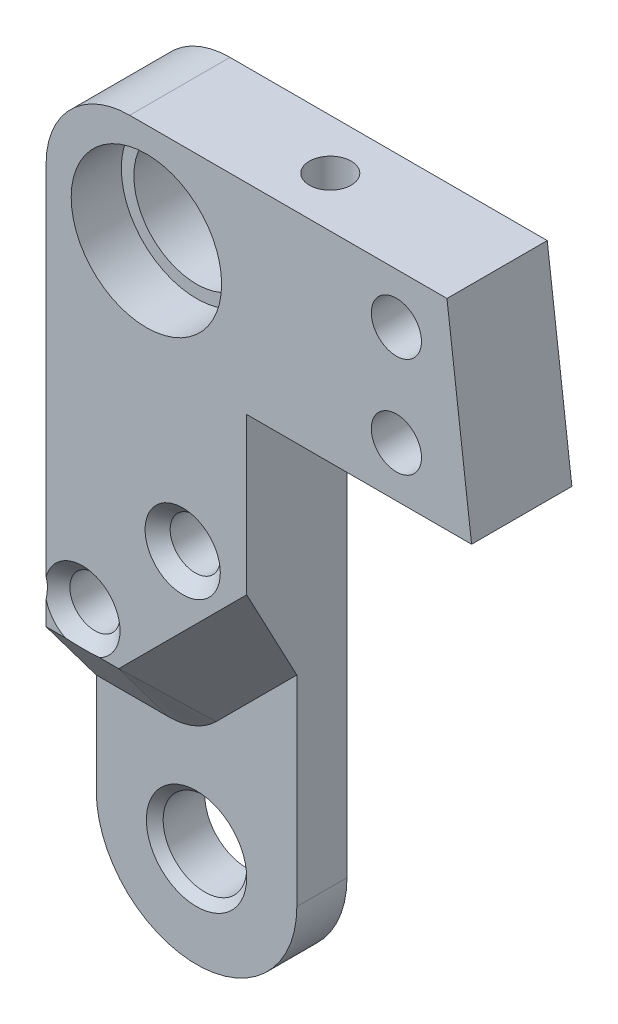
ISO-10303-21;
HEADER;
FILE_DESCRIPTION(('STEP AP214'),'2;1');
FILE_NAME('part.step','',(''),(''),'','','');
FILE_SCHEMA(('AUTOMOTIVE_DESIGN { 1 0 10303 214 1 1 1 1 }'));
ENDSEC;
DATA;
#1=APPLICATION_CONTEXT('core data for automotive mechanical design processes');
#2=APPLICATION_PROTOCOL_DEFINITION('international standard','automotive_design',2000,#1);
#3=PRODUCT_CONTEXT('',#1,'mechanical');
#4=PRODUCT('Part','Part','',(#3));
#5=PRODUCT_RELATED_PRODUCT_CATEGORY('part','',(#4));
#6=PRODUCT_DEFINITION_FORMATION('','',#4);
#7=PRODUCT_DEFINITION_CONTEXT('part definition',#1,'design');
#8=PRODUCT_DEFINITION('design','',#6,#7);
#9=PRODUCT_DEFINITION_SHAPE('','',#8);
#10=(LENGTH_UNIT() NAMED_UNIT(*) SI_UNIT(.MILLI.,.METRE.));
#11=(NAMED_UNIT(*) PLANE_ANGLE_UNIT() SI_UNIT($,.RADIAN.));
#12=(NAMED_UNIT(*) SI_UNIT($,.STERADIAN.) SOLID_ANGLE_UNIT());
#13=UNCERTAINTY_MEASURE_WITH_UNIT(LENGTH_MEASURE(1.E-05),#10,'distance_accuracy_value','');
#14=(GEOMETRIC_REPRESENTATION_CONTEXT(3) GLOBAL_UNCERTAINTY_ASSIGNED_CONTEXT((#13)) GLOBAL_UNIT_ASSIGNED_CONTEXT((#10,
#11,#12)) REPRESENTATION_CONTEXT('',''));
#15=CARTESIAN_POINT('',(0.,0.,0.));
#16=DIRECTION('',(0.,0.,1.));
#17=DIRECTION('',(1.,0.,0.));
#18=AXIS2_PLACEMENT_3D('',#15,#16,#17);
#19=CARTESIAN_POINT('',(-3.82842712474619,18.,-0.00100000000000013));
#20=DIRECTION('',(0.,0.,1.));
#21=DIRECTION('',(1.,0.,0.));
#22=AXIS2_PLACEMENT_3D('',#19,#20,#21);
#23=CYLINDRICAL_SURFACE('',#22,1.5);
#24=CARTESIAN_POINT('',(-3.82842712474619,18.,5.24999999999999));
#25=DIRECTION('',(0.,0.,1.));
#26=DIRECTION('',(1.,0.,0.));
#27=AXIS2_PLACEMENT_3D('',#24,#25,#26);
#28=CIRCLE('',#27,1.5);
#29=CARTESIAN_POINT('',(-2.32842712474619,18.,5.24999999999999));
#30=VERTEX_POINT('',#29);
#31=EDGE_CURVE('E214',#30,#30,#28,.T.);
#32=CARTESIAN_POINT('',(-3.82842712474619,18.,1.));
#33=DIRECTION('',(0.,0.,-1.));
#34=DIRECTION('',(-1.,0.,0.));
#35=AXIS2_PLACEMENT_3D('',#32,#33,#34);
#36=CIRCLE('',#35,1.5);
#37=CARTESIAN_POINT('',(-2.32842712474619,18.,1.));
#38=VERTEX_POINT('',#37);
#39=EDGE_CURVE('E38',#38,#38,#36,.F.);
#40=CARTESIAN_POINT('',(-2.32842712474619,18.,5.24999999999999));
#41=CARTESIAN_POINT('',(-2.32842712474619,18.,5.20572916666665));
#42=CARTESIAN_POINT('',(-2.32842712474619,18.,5.16145833333332));
#43=CARTESIAN_POINT('',(-2.32842712474619,18.,5.07291666666665));
#44=CARTESIAN_POINT('',(-2.32842712474619,18.,5.02864583333332));
#45=CARTESIAN_POINT('',(-2.32842712474619,18.,4.94010416666666));
#46=CARTESIAN_POINT('',(-2.32842712474619,18.,4.89583333333332));
#47=CARTESIAN_POINT('',(-2.32842712474619,18.,4.80729166666666));
#48=CARTESIAN_POINT('',(-2.32842712474619,18.,4.76302083333332));
#49=CARTESIAN_POINT('',(-2.32842712474619,18.,4.67447916666666));
#50=CARTESIAN_POINT('',(-2.32842712474619,18.,4.63020833333332));
#51=CARTESIAN_POINT('',(-2.32842712474619,18.,4.54166666666666));
#52=CARTESIAN_POINT('',(-2.32842712474619,18.,4.49739583333332));
#53=CARTESIAN_POINT('',(-2.32842712474619,18.,4.40885416666666));
#54=CARTESIAN_POINT('',(-2.32842712474619,18.,4.36458333333332));
#55=CARTESIAN_POINT('',(-2.32842712474619,18.,4.27604166666666));
#56=CARTESIAN_POINT('',(-2.32842712474619,18.,4.23177083333332));
#57=CARTESIAN_POINT('',(-2.32842712474619,18.,4.14322916666666));
#58=CARTESIAN_POINT('',(-2.32842712474619,18.,4.09895833333332));
#59=CARTESIAN_POINT('',(-2.32842712474619,18.,4.01041666666666));
#60=CARTESIAN_POINT('',(-2.32842712474619,18.,3.96614583333332));
#61=CARTESIAN_POINT('',(-2.32842712474619,18.,3.87760416666666));
#62=CARTESIAN_POINT('',(-2.32842712474619,18.,3.83333333333333));
#63=CARTESIAN_POINT('',(-2.32842712474619,18.,3.74479166666666));
#64=CARTESIAN_POINT('',(-2.32842712474619,18.,3.70052083333333));
#65=CARTESIAN_POINT('',(-2.32842712474619,18.,3.61197916666666));
#66=CARTESIAN_POINT('',(-2.32842712474619,18.,3.56770833333333));
#67=CARTESIAN_POINT('',(-2.32842712474619,18.,3.47916666666666));
#68=CARTESIAN_POINT('',(-2.32842712474619,18.,3.43489583333333));
#69=CARTESIAN_POINT('',(-2.32842712474619,18.,3.34635416666666));
#70=CARTESIAN_POINT('',(-2.32842712474619,18.,3.30208333333333));
#71=CARTESIAN_POINT('',(-2.32842712474619,18.,3.21354166666666));
#72=CARTESIAN_POINT('',(-2.32842712474619,18.,3.16927083333333));
#73=CARTESIAN_POINT('',(-2.32842712474619,18.,3.08072916666666));
#74=CARTESIAN_POINT('',(-2.32842712474619,18.,3.03645833333333));
#75=CARTESIAN_POINT('',(-2.32842712474619,18.,2.94791666666666));
#76=CARTESIAN_POINT('',(-2.32842712474619,18.,2.90364583333333));
#77=CARTESIAN_POINT('',(-2.32842712474619,18.,2.81510416666666));
#78=CARTESIAN_POINT('',(-2.32842712474619,18.,2.77083333333333));
#79=CARTESIAN_POINT('',(-2.32842712474619,18.,2.68229166666666));
#80=CARTESIAN_POINT('',(-2.32842712474619,18.,2.63802083333333));
#81=CARTESIAN_POINT('',(-2.32842712474619,18.,2.54947916666666));
#82=CARTESIAN_POINT('',(-2.32842712474619,18.,2.50520833333333));
#83=CARTESIAN_POINT('',(-2.32842712474619,18.,2.41666666666666));
#84=CARTESIAN_POINT('',(-2.32842712474619,18.,2.37239583333333));
#85=CARTESIAN_POINT('',(-2.32842712474619,18.,2.28385416666666));
#86=CARTESIAN_POINT('',(-2.32842712474619,18.,2.23958333333333));
#87=CARTESIAN_POINT('',(-2.32842712474619,18.,2.15104166666666));
#88=CARTESIAN_POINT('',(-2.32842712474619,18.,2.10677083333333));
#89=CARTESIAN_POINT('',(-2.32842712474619,18.,2.01822916666666));
#90=CARTESIAN_POINT('',(-2.32842712474619,18.,1.97395833333333));
#91=CARTESIAN_POINT('',(-2.32842712474619,18.,1.88541666666666));
#92=CARTESIAN_POINT('',(-2.32842712474619,18.,1.84114583333333));
#93=CARTESIAN_POINT('',(-2.32842712474619,18.,1.75260416666666));
#94=CARTESIAN_POINT('',(-2.32842712474619,18.,1.70833333333333));
#95=CARTESIAN_POINT('',(-2.32842712474619,18.,1.61979166666666));
#96=CARTESIAN_POINT('',(-2.32842712474619,18.,1.57552083333333));
#97=CARTESIAN_POINT('',(-2.32842712474619,18.,1.48697916666667));
#98=CARTESIAN_POINT('',(-2.32842712474619,18.,1.44270833333333));
#99=CARTESIAN_POINT('',(-2.32842712474619,18.,1.35416666666667));
#100=CARTESIAN_POINT('',(-2.32842712474619,18.,1.30989583333333));
#101=CARTESIAN_POINT('',(-2.32842712474619,18.,1.22135416666667));
#102=CARTESIAN_POINT('',(-2.32842712474619,18.,1.17708333333333));
#103=CARTESIAN_POINT('',(-2.32842712474619,18.,1.08854166666667));
#104=CARTESIAN_POINT('',(-2.32842712474619,18.,1.04427083333333));
#105=CARTESIAN_POINT('',(-2.32842712474619,18.,1.));
#106=B_SPLINE_CURVE_WITH_KNOTS('',3,(#40,#41,#42,#43,#44,#45,#46,#47,#48,#49,#50,#51,#52,#53,
#54,#55,#56,#57,#58,#59,#60,#61,#62,#63,#64,#65,#66,#67,#68,#69,#70,#71,#72,#73,#74,#75,#76,#77,
#78,#79,#80,#81,#82,#83,#84,#85,#86,#87,#88,#89,#90,#91,#92,#93,#94,#95,#96,#97,#98,#99,#100,
#101,#102,#103,#104,#105),.UNSPECIFIED.,.F.,.F.,(4,2,2,2,2,2,2,2,2,2,2,2,2,2,2,2,2,2,2,2,2,2,2,
2,2,2,2,2,2,2,2,2,4),(0.,0.132812499999999,0.265624999999999,0.398437499999999,
0.531249999999999,0.664062499999998,0.796874999999998,0.929687499999997,1.0625,1.1953125,
1.328125,1.4609375,1.59374999999999,1.7265625,1.85937499999999,1.99218749999999,
2.12499999999999,2.25781249999999,2.39062499999999,2.52343749999999,2.65624999999999,
2.78906249999999,2.92187499999999,3.05468749999999,3.18749999999999,3.32031249999999,
3.45312499999999,3.58593749999999,3.71874999999999,3.85156249999999,3.98437499999999,
4.11718749999999,4.24999999999999),.UNSPECIFIED.);
#107=EDGE_CURVE('BSEAM34',#30,#38,#106,.T.);
#108=ORIENTED_EDGE('',*,*,#31,.T.);
#109=ORIENTED_EDGE('',*,*,#39,.F.);
#110=ORIENTED_EDGE('',*,*,#107,.T.);
#111=ORIENTED_EDGE('',*,*,#107,.F.);
#112=EDGE_LOOP('',(#108,#110,#109,#111));
#113=FACE_BOUND('',#112,.T.);
#114=ADVANCED_FACE('F34',(#113),#23,.F.);
#115=CARTESIAN_POINT('',(2.17157287525381,24.,-0.00100000000000013));
#116=DIRECTION('',(0.,0.,1.));
#117=DIRECTION('',(1.,0.,0.));
#118=AXIS2_PLACEMENT_3D('',#115,#116,#117);
#119=CYLINDRICAL_SURFACE('',#118,1.5);
#120=CARTESIAN_POINT('',(2.17157287525381,24.,5.24999999999998));
#121=DIRECTION('',(0.,0.,1.));
#122=DIRECTION('',(1.,0.,0.));
#123=AXIS2_PLACEMENT_3D('',#120,#121,#122);
#124=CIRCLE('',#123,1.5);
#125=CARTESIAN_POINT('',(3.67157287525381,24.,5.24999999999998));
#126=VERTEX_POINT('',#125);
#127=EDGE_CURVE('E194',#126,#126,#124,.T.);
#128=CARTESIAN_POINT('',(2.17157287525381,24.,1.));
#129=DIRECTION('',(0.,0.,-1.));
#130=DIRECTION('',(-1.,0.,0.));
#131=AXIS2_PLACEMENT_3D('',#128,#129,#130);
#132=CIRCLE('',#131,1.5);
#133=CARTESIAN_POINT('',(3.67157287525381,24.,1.));
#134=VERTEX_POINT('',#133);
#135=EDGE_CURVE('E570',#134,#134,#132,.F.);
#136=CARTESIAN_POINT('',(3.67157287525381,24.,5.24999999999998));
#137=CARTESIAN_POINT('',(3.67157287525381,24.,5.20572916666664));
#138=CARTESIAN_POINT('',(3.67157287525381,24.,5.16145833333331));
#139=CARTESIAN_POINT('',(3.67157287525381,24.,5.07291666666664));
#140=CARTESIAN_POINT('',(3.67157287525381,24.,5.02864583333331));
#141=CARTESIAN_POINT('',(3.67157287525381,24.,4.94010416666664));
#142=CARTESIAN_POINT('',(3.67157287525381,24.,4.89583333333331));
#143=CARTESIAN_POINT('',(3.67157287525381,24.,4.80729166666664));
#144=CARTESIAN_POINT('',(3.67157287525381,24.,4.76302083333331));
#145=CARTESIAN_POINT('',(3.67157287525381,24.,4.67447916666665));
#146=CARTESIAN_POINT('',(3.67157287525381,24.,4.63020833333331));
#147=CARTESIAN_POINT('',(3.67157287525381,24.,4.54166666666665));
#148=CARTESIAN_POINT('',(3.67157287525381,24.,4.49739583333331));
#149=CARTESIAN_POINT('',(3.67157287525381,24.,4.40885416666665));
#150=CARTESIAN_POINT('',(3.67157287525381,24.,4.36458333333331));
#151=CARTESIAN_POINT('',(3.67157287525381,24.,4.27604166666665));
#152=CARTESIAN_POINT('',(3.67157287525381,24.,4.23177083333331));
#153=CARTESIAN_POINT('',(3.67157287525381,24.,4.14322916666665));
#154=CARTESIAN_POINT('',(3.67157287525381,24.,4.09895833333331));
#155=CARTESIAN_POINT('',(3.67157287525381,24.,4.01041666666665));
#156=CARTESIAN_POINT('',(3.67157287525381,24.,3.96614583333332));
#157=CARTESIAN_POINT('',(3.67157287525381,24.,3.87760416666665));
#158=CARTESIAN_POINT('',(3.67157287525381,24.,3.83333333333332));
#159=CARTESIAN_POINT('',(3.67157287525381,24.,3.74479166666665));
#160=CARTESIAN_POINT('',(3.67157287525381,24.,3.70052083333332));
#161=CARTESIAN_POINT('',(3.67157287525381,24.,3.61197916666665));
#162=CARTESIAN_POINT('',(3.67157287525381,24.,3.56770833333332));
#163=CARTESIAN_POINT('',(3.67157287525381,24.,3.47916666666665));
#164=CARTESIAN_POINT('',(3.67157287525381,24.,3.43489583333332));
#165=CARTESIAN_POINT('',(3.67157287525381,24.,3.34635416666665));
#166=CARTESIAN_POINT('',(3.67157287525381,24.,3.30208333333332));
#167=CARTESIAN_POINT('',(3.67157287525381,24.,3.21354166666665));
#168=CARTESIAN_POINT('',(3.67157287525381,24.,3.16927083333332));
#169=CARTESIAN_POINT('',(3.67157287525381,24.,3.08072916666665));
#170=CARTESIAN_POINT('',(3.67157287525381,24.,3.03645833333332));
#171=CARTESIAN_POINT('',(3.67157287525381,24.,2.94791666666665));
#172=CARTESIAN_POINT('',(3.67157287525381,24.,2.90364583333332));
#173=CARTESIAN_POINT('',(3.67157287525381,24.,2.81510416666666));
#174=CARTESIAN_POINT('',(3.67157287525381,24.,2.77083333333332));
#175=CARTESIAN_POINT('',(3.67157287525381,24.,2.68229166666666));
#176=CARTESIAN_POINT('',(3.67157287525381,24.,2.63802083333332));
#177=CARTESIAN_POINT('',(3.67157287525381,24.,2.54947916666666));
#178=CARTESIAN_POINT('',(3.67157287525381,24.,2.50520833333332));
#179=CARTESIAN_POINT('',(3.67157287525381,24.,2.41666666666666));
#180=CARTESIAN_POINT('',(3.67157287525381,24.,2.37239583333333));
#181=CARTESIAN_POINT('',(3.67157287525381,24.,2.28385416666666));
#182=CARTESIAN_POINT('',(3.67157287525381,24.,2.23958333333333));
#183=CARTESIAN_POINT('',(3.67157287525381,24.,2.15104166666666));
#184=CARTESIAN_POINT('',(3.67157287525381,24.,2.10677083333333));
#185=CARTESIAN_POINT('',(3.67157287525381,24.,2.01822916666666));
#186=CARTESIAN_POINT('',(3.67157287525381,24.,1.97395833333333));
#187=CARTESIAN_POINT('',(3.67157287525381,24.,1.88541666666666));
#188=CARTESIAN_POINT('',(3.67157287525381,24.,1.84114583333333));
#189=CARTESIAN_POINT('',(3.67157287525381,24.,1.75260416666666));
#190=CARTESIAN_POINT('',(3.67157287525381,24.,1.70833333333333));
#191=CARTESIAN_POINT('',(3.67157287525381,24.,1.61979166666666));
#192=CARTESIAN_POINT('',(3.67157287525381,24.,1.57552083333333));
#193=CARTESIAN_POINT('',(3.67157287525381,24.,1.48697916666666));
#194=CARTESIAN_POINT('',(3.67157287525381,24.,1.44270833333333));
#195=CARTESIAN_POINT('',(3.67157287525381,24.,1.35416666666666));
#196=CARTESIAN_POINT('',(3.67157287525381,24.,1.30989583333333));
#197=CARTESIAN_POINT('',(3.67157287525381,24.,1.22135416666667));
#198=CARTESIAN_POINT('',(3.67157287525381,24.,1.17708333333333));
#199=CARTESIAN_POINT('',(3.67157287525381,24.,1.08854166666667));
#200=CARTESIAN_POINT('',(3.67157287525381,24.,1.04427083333333));
#201=CARTESIAN_POINT('',(3.67157287525381,24.,1.));
#202=B_SPLINE_CURVE_WITH_KNOTS('',3,(#136,#137,#138,#139,#140,#141,#142,#143,#144,#145,#146,
#147,#148,#149,#150,#151,#152,#153,#154,#155,#156,#157,#158,#159,#160,#161,#162,#163,#164,#165,
#166,#167,#168,#169,#170,#171,#172,#173,#174,#175,#176,#177,#178,#179,#180,#181,#182,#183,#184,
#185,#186,#187,#188,#189,#190,#191,#192,#193,#194,#195,#196,#197,#198,#199,#200,#201),
.UNSPECIFIED.,.F.,.F.,(4,2,2,2,2,2,2,2,2,2,2,2,2,2,2,2,2,2,2,2,2,2,2,2,2,2,2,2,2,2,2,2,4),(0.,
0.132812499999999,0.265624999999999,0.398437499999998,0.531249999999997,0.664062499999996,
0.796874999999996,0.929687499999995,1.06249999999999,1.19531249999999,1.32812499999999,
1.46093749999999,1.59374999999999,1.72656249999999,1.85937499999999,1.99218749999999,
2.12499999999999,2.25781249999999,2.39062499999999,2.52343749999999,2.65624999999998,
2.78906249999998,2.92187499999998,3.05468749999998,3.18749999999998,3.32031249999998,
3.45312499999998,3.58593749999998,3.71874999999998,3.85156249999998,3.98437499999998,
4.11718749999998,4.24999999999998),.UNSPECIFIED.);
#203=EDGE_CURVE('BSEAM284',#126,#134,#202,.T.);
#204=ORIENTED_EDGE('',*,*,#127,.T.);
#205=ORIENTED_EDGE('',*,*,#135,.F.);
#206=ORIENTED_EDGE('',*,*,#203,.T.);
#207=ORIENTED_EDGE('',*,*,#203,.F.);
#208=EDGE_LOOP('',(#204,#206,#205,#207));
#209=FACE_BOUND('',#208,.T.);
#210=ADVANCED_FACE('F284',(#209),#119,.F.);
#211=CARTESIAN_POINT('',(-1.65685424949238,16.,6.));
#212=DIRECTION('',(0.,0.,1.));
#213=DIRECTION('',(1.,0.,0.));
#214=AXIS2_PLACEMENT_3D('',#211,#212,#213);
#215=PLANE('',#214);
#216=CARTESIAN_POINT('',(2.17157287525381,24.,6.));
#217=DIRECTION('',(0.,0.,1.));
#218=DIRECTION('',(1.,0.,0.));
#219=AXIS2_PLACEMENT_3D('',#216,#217,#218);
#220=CIRCLE('',#219,2.25000000000002);
#221=CARTESIAN_POINT('',(4.42157287525383,24.,6.));
#222=VERTEX_POINT('',#221);
#223=EDGE_CURVE('E211',#222,#222,#220,.F.);
#224=ORIENTED_EDGE('',*,*,#223,.T.);
#225=EDGE_LOOP('',(#224));
#226=FACE_BOUND('',#225,.T.);
#227=CARTESIAN_POINT('',(0.,39.,6.));
#228=DIRECTION('',(0.,0.,1.));
#229=DIRECTION('',(1.,0.,0.));
#230=AXIS2_PLACEMENT_3D('',#227,#228,#229);
#231=CIRCLE('',#230,4.5);
#232=CARTESIAN_POINT('',(4.5,39.,6.));
#233=VERTEX_POINT('',#232);
#234=EDGE_CURVE('E204',#233,#233,#231,.T.);
#235=ORIENTED_EDGE('',*,*,#234,.F.);
#236=EDGE_LOOP('',(#235));
#237=FACE_BOUND('',#236,.T.);
#238=CARTESIAN_POINT('',(14.9545389109916,42.0000000000002,6.));
#239=DIRECTION('',(0.,0.,1.));
#240=DIRECTION('',(1.,0.,0.));
#241=AXIS2_PLACEMENT_3D('',#238,#239,#240);
#242=CIRCLE('',#241,1.5);
#243=CARTESIAN_POINT('',(16.4545389109916,42.0000000000002,6.));
#244=VERTEX_POINT('',#243);
#245=EDGE_CURVE('E355',#244,#244,#242,.F.);
#246=ORIENTED_EDGE('',*,*,#245,.T.);
#247=EDGE_LOOP('',(#246));
#248=FACE_BOUND('',#247,.T.);
#249=CARTESIAN_POINT('',(14.9545389109916,36.0000000000002,6.));
#250=DIRECTION('',(0.,0.,1.));
#251=DIRECTION('',(1.,0.,0.));
#252=AXIS2_PLACEMENT_3D('',#249,#250,#251);
#253=CIRCLE('',#252,1.5);
#254=CARTESIAN_POINT('',(16.4545389109916,36.0000000000002,6.));
#255=VERTEX_POINT('',#254);
#256=EDGE_CURVE('E573',#255,#255,#253,.F.);
#257=ORIENTED_EDGE('',*,*,#256,.T.);
#258=EDGE_LOOP('',(#257));
#259=FACE_BOUND('',#258,.T.);
#260=DIRECTION('',(0.,-1.,0.));
#261=VECTOR('',#260,1.);
#262=CARTESIAN_POINT('',(-6.,40.,6.));
#263=LINE('',#262,#261);
#264=CARTESIAN_POINT('',(-6.,40.,6.));
#265=VERTEX_POINT('',#264);
#266=CARTESIAN_POINT('',(-6.,18.5888728618827,6.));
#267=VERTEX_POINT('',#266);
#268=EDGE_CURVE('E167',#265,#267,#263,.T.);
#269=ORIENTED_EDGE('',*,*,#268,.T.);
#270=CARTESIAN_POINT('',(-3.82842712474619,18.,6.));
#271=DIRECTION('',(0.,0.,1.));
#272=DIRECTION('',(1.,0.,0.));
#273=AXIS2_PLACEMENT_3D('',#270,#271,#272);
#274=CIRCLE('',#273,2.25000000000001);
#275=CARTESIAN_POINT('',(-2.79765071834179,16.,6.));
#276=VERTEX_POINT('',#275);
#277=EDGE_CURVE('E208',#267,#276,#274,.F.);
#278=ORIENTED_EDGE('',*,*,#277,.T.);
#279=DIRECTION('',(1.,0.,0.));
#280=VECTOR('',#279,1.);
#281=CARTESIAN_POINT('',(-1.6568542494924,16.,6.));
#282=LINE('',#281,#280);
#283=CARTESIAN_POINT('',(-1.65685424949238,16.,6.));
#284=VERTEX_POINT('',#283);
#285=EDGE_CURVE('E185',#276,#284,#282,.T.);
#286=ORIENTED_EDGE('',*,*,#285,.T.);
#287=DIRECTION('',(0.707106781186547,0.707106781186548,0.));
#288=VECTOR('',#287,1.);
#289=CARTESIAN_POINT('',(3.1715728752538,20.8284271247462,6.));
#290=LINE('',#289,#288);
#291=CARTESIAN_POINT('',(6.,23.6568542494924,6.));
#292=VERTEX_POINT('',#291);
#293=EDGE_CURVE('E139',#284,#292,#290,.T.);
#294=ORIENTED_EDGE('',*,*,#293,.T.);
#295=DIRECTION('',(0.,1.,0.));
#296=VECTOR('',#295,1.);
#297=CARTESIAN_POINT('',(6.,33.,6.));
#298=LINE('',#297,#296);
#299=CARTESIAN_POINT('',(6.,33.,6.));
#300=VERTEX_POINT('',#299);
#301=EDGE_CURVE('E131',#292,#300,#298,.T.);
#302=ORIENTED_EDGE('',*,*,#301,.T.);
#303=DIRECTION('',(1.,0.,0.));
#304=VECTOR('',#303,1.);
#305=CARTESIAN_POINT('',(6.,33.,6.));
#306=LINE('',#305,#304);
#307=CARTESIAN_POINT('',(19.4545389109915,33.,6.));
#308=VERTEX_POINT('',#307);
#309=EDGE_CURVE('E136',#300,#308,#306,.T.);
#310=ORIENTED_EDGE('',*,*,#309,.T.);
#311=DIRECTION('',(-0.121869343405148,0.992546151641322,0.));
#312=VECTOR('',#311,1.);
#313=CARTESIAN_POINT('',(19.4545389109915,33.,6.));
#314=LINE('',#313,#312);
#315=CARTESIAN_POINT('',(17.9811241801567,45.,6.));
#316=VERTEX_POINT('',#315);
#317=EDGE_CURVE('E155',#308,#316,#314,.T.);
#318=ORIENTED_EDGE('',*,*,#317,.T.);
#319=DIRECTION('',(-1.,0.,0.));
#320=VECTOR('',#319,1.);
#321=CARTESIAN_POINT('',(17.9811241801567,45.,6.));
#322=LINE('',#321,#320);
#323=CARTESIAN_POINT('',(-0.999999999999966,45.,6.));
#324=VERTEX_POINT('',#323);
#325=EDGE_CURVE('E157',#316,#324,#322,.T.);
#326=ORIENTED_EDGE('',*,*,#325,.T.);
#327=CARTESIAN_POINT('',(-1.,40.,6.));
#328=DIRECTION('',(0.,0.,1.));
#329=DIRECTION('',(1.,0.,0.));
#330=AXIS2_PLACEMENT_3D('',#327,#328,#329);
#331=CIRCLE('',#330,5.);
#332=EDGE_CURVE('E163',#324,#265,#331,.T.);
#333=ORIENTED_EDGE('',*,*,#332,.T.);
#334=EDGE_LOOP('',(#269,#278,#286,#294,#302,#310,#318,#326,#333));
#335=FACE_BOUND('',#334,.T.);
#336=ADVANCED_FACE('F133',(#226,#237,#248,#259,#335),#215,.T.);
#337=CARTESIAN_POINT('',(0.,39.,3.));
#338=DIRECTION('',(0.,0.,-1.));
#339=DIRECTION('',(-1.,0.,0.));
#340=AXIS2_PLACEMENT_3D('',#337,#338,#339);
#341=CYLINDRICAL_SURFACE('',#340,4.5);
#342=ORIENTED_EDGE('',*,*,#234,.T.);
#343=EDGE_LOOP('',(#342));
#344=FACE_BOUND('',#343,.T.);
#345=CARTESIAN_POINT('',(0.,39.,3.));
#346=DIRECTION('',(0.,0.,-1.));
#347=DIRECTION('',(-1.,0.,0.));
#348=AXIS2_PLACEMENT_3D('',#345,#346,#347);
#349=CIRCLE('',#348,4.5);
#350=CARTESIAN_POINT('',(-4.5,39.,3.));
#351=VERTEX_POINT('',#350);
#352=EDGE_CURVE('E353',#351,#351,#349,.T.);
#353=ORIENTED_EDGE('',*,*,#352,.T.);
#354=EDGE_LOOP('',(#353));
#355=FACE_BOUND('',#354,.T.);
#356=ADVANCED_FACE('F243',(#344,#355),#341,.F.);
#357=CARTESIAN_POINT('',(17.9811241801567,45.,3.));
#358=DIRECTION('',(0.,-1.,0.));
#359=DIRECTION('',(0.,0.,-1.));
#360=AXIS2_PLACEMENT_3D('',#357,#358,#359);
#361=PLANE('',#360);
#362=DIRECTION('',(-1.,0.,0.));
#363=VECTOR('',#362,1.);
#364=CARTESIAN_POINT('',(17.9811241801567,45.,0.));
#365=LINE('',#364,#363);
#366=CARTESIAN_POINT('',(17.9811241801567,45.,0.));
#367=VERTEX_POINT('',#366);
#368=CARTESIAN_POINT('',(-0.999999999999966,45.,0.));
#369=VERTEX_POINT('',#368);
#370=EDGE_CURVE('E385',#367,#369,#365,.T.);
#371=ORIENTED_EDGE('',*,*,#370,.T.);
#372=DIRECTION('',(0.,0.,-1.));
#373=VECTOR('',#372,1.);
#374=CARTESIAN_POINT('',(-0.999999999999966,45.,3.));
#375=LINE('',#374,#373);
#376=EDGE_CURVE('E399',#324,#369,#375,.T.);
#377=ORIENTED_EDGE('',*,*,#376,.F.);
#378=ORIENTED_EDGE('',*,*,#325,.F.);
#379=DIRECTION('',(0.,0.,-1.));
#380=VECTOR('',#379,1.);
#381=CARTESIAN_POINT('',(17.9811241801567,45.,3.));
#382=LINE('',#381,#380);
#383=EDGE_CURVE('E402',#316,#367,#382,.T.);
#384=ORIENTED_EDGE('',*,*,#383,.T.);
#385=EDGE_LOOP('',(#371,#377,#378,#384));
#386=FACE_BOUND('',#385,.T.);
#387=CARTESIAN_POINT('',(8.00000000000003,45.,3.));
#388=DIRECTION('',(0.,1.,0.));
#389=DIRECTION('',(0.,0.,1.));
#390=AXIS2_PLACEMENT_3D('',#387,#388,#389);
#391=CIRCLE('',#390,1.24999999999999);
#392=CARTESIAN_POINT('',(8.00000000000003,45.,4.24999999999999));
#393=VERTEX_POINT('',#392);
#394=EDGE_CURVE('E361',#393,#393,#391,.T.);
#395=ORIENTED_EDGE('',*,*,#394,.F.);
#396=EDGE_LOOP('',(#395));
#397=FACE_BOUND('',#396,.T.);
#398=ADVANCED_FACE('F239',(#386,#397),#361,.F.);
#399=CARTESIAN_POINT('',(0.,6.,3.));
#400=DIRECTION('',(0.,0.,1.));
#401=DIRECTION('',(1.,0.,0.));
#402=AXIS2_PLACEMENT_3D('',#399,#400,#401);
#403=PLANE('',#402);
#404=CARTESIAN_POINT('',(0.,5.99999999999985,3.));
#405=DIRECTION('',(0.,0.,1.));
#406=DIRECTION('',(1.,0.,0.));
#407=AXIS2_PLACEMENT_3D('',#404,#405,#406);
#408=CIRCLE('',#407,2.99999999999988);
#409=CARTESIAN_POINT('',(2.99999999999981,5.99999999999985,3.));
#410=VERTEX_POINT('',#409);
#411=EDGE_CURVE('E43',#410,#410,#408,.F.);
#412=ORIENTED_EDGE('',*,*,#411,.T.);
#413=EDGE_LOOP('',(#412));
#414=FACE_BOUND('',#413,.T.);
#415=DIRECTION('',(0.707106781186548,0.707106781186548,0.));
#416=VECTOR('',#415,1.);
#417=CARTESIAN_POINT('',(1.17157287525382,13.1715728752538,3.));
#418=LINE('',#417,#416);
#419=CARTESIAN_POINT('',(1.17157287525382,13.1715728752538,3.));
#420=VERTEX_POINT('',#419);
#421=CARTESIAN_POINT('',(6.,18.,3.));
#422=VERTEX_POINT('',#421);
#423=EDGE_CURVE('E141',#420,#422,#418,.T.);
#424=ORIENTED_EDGE('',*,*,#423,.F.);
#425=CARTESIAN_POINT('',(-1.65685424949238,16.,3.));
#426=DIRECTION('',(0.,0.,1.));
#427=DIRECTION('',(1.,0.,0.));
#428=AXIS2_PLACEMENT_3D('',#425,#426,#427);
#429=CIRCLE('',#428,4.);
#430=CARTESIAN_POINT('',(-1.6568542494924,12.,3.));
#431=VERTEX_POINT('',#430);
#432=EDGE_CURVE('E169',#431,#420,#429,.T.);
#433=ORIENTED_EDGE('',*,*,#432,.F.);
#434=DIRECTION('',(1.,0.,0.));
#435=VECTOR('',#434,1.);
#436=CARTESIAN_POINT('',(-6.,12.,3.));
#437=LINE('',#436,#435);
#438=CARTESIAN_POINT('',(-6.,12.,3.));
#439=VERTEX_POINT('',#438);
#440=EDGE_CURVE('E172',#439,#431,#437,.T.);
#441=ORIENTED_EDGE('',*,*,#440,.F.);
#442=DIRECTION('',(0.,-1.,0.));
#443=VECTOR('',#442,1.);
#444=CARTESIAN_POINT('',(-6.,40.,3.));
#445=LINE('',#444,#443);
#446=CARTESIAN_POINT('',(-6.,6.,3.));
#447=VERTEX_POINT('',#446);
#448=EDGE_CURVE('E371',#439,#447,#445,.T.);
#449=ORIENTED_EDGE('',*,*,#448,.T.);
#450=CARTESIAN_POINT('',(0.,6.,3.));
#451=DIRECTION('',(0.,0.,1.));
#452=DIRECTION('',(1.,0.,0.));
#453=AXIS2_PLACEMENT_3D('',#450,#451,#452);
#454=CIRCLE('',#453,6.);
#455=CARTESIAN_POINT('',(6.,6.,3.));
#456=VERTEX_POINT('',#455);
#457=EDGE_CURVE('E175',#447,#456,#454,.T.);
#458=ORIENTED_EDGE('',*,*,#457,.T.);
#459=DIRECTION('',(0.,1.,0.));
#460=VECTOR('',#459,1.);
#461=CARTESIAN_POINT('',(6.,25.,3.));
#462=LINE('',#461,#460);
#463=EDGE_CURVE('E375',#456,#422,#462,.T.);
#464=ORIENTED_EDGE('',*,*,#463,.T.);
#465=EDGE_LOOP('',(#424,#433,#441,#449,#458,#464));
#466=FACE_BOUND('',#465,.T.);
#467=ADVANCED_FACE('F242',(#414,#466),#403,.T.);
#468=CARTESIAN_POINT('',(0.,6.,0.));
#469=DIRECTION('',(0.,0.,1.));
#470=DIRECTION('',(1.,0.,0.));
#471=AXIS2_PLACEMENT_3D('',#468,#469,#470);
#472=PLANE('',#471);
#473=CARTESIAN_POINT('',(-3.82842712474619,18.,0.));
#474=DIRECTION('',(0.,0.,-1.));
#475=DIRECTION('',(-1.,0.,0.));
#476=AXIS2_PLACEMENT_3D('',#473,#474,#475);
#477=CIRCLE('',#476,1.9);
#478=CARTESIAN_POINT('',(-5.72842712474619,18.,0.));
#479=VERTEX_POINT('',#478);
#480=EDGE_CURVE('E326',#479,#479,#477,.T.);
#481=ORIENTED_EDGE('',*,*,#480,.F.);
#482=EDGE_LOOP('',(#481));
#483=FACE_BOUND('',#482,.T.);
#484=CARTESIAN_POINT('',(2.17157287525381,24.,0.));
#485=DIRECTION('',(0.,0.,-1.));
#486=DIRECTION('',(-1.,0.,0.));
#487=AXIS2_PLACEMENT_3D('',#484,#485,#486);
#488=CIRCLE('',#487,1.9);
#489=CARTESIAN_POINT('',(0.27157287525381,24.,0.));
#490=VERTEX_POINT('',#489);
#491=EDGE_CURVE('E330',#490,#490,#488,.T.);
#492=ORIENTED_EDGE('',*,*,#491,.F.);
#493=EDGE_LOOP('',(#492));
#494=FACE_BOUND('',#493,.T.);
#495=CARTESIAN_POINT('',(0.,5.99999999999985,0.));
#496=DIRECTION('',(0.,0.,-1.));
#497=DIRECTION('',(-1.,0.,0.));
#498=AXIS2_PLACEMENT_3D('',#495,#496,#497);
#499=CIRCLE('',#498,2.49999999999988);
#500=CARTESIAN_POINT('',(-2.49999999999996,5.99999999999985,0.));
#501=VERTEX_POINT('',#500);
#502=EDGE_CURVE('E334',#501,#501,#499,.T.);
#503=ORIENTED_EDGE('',*,*,#502,.F.);
#504=EDGE_LOOP('',(#503));
#505=FACE_BOUND('',#504,.T.);
#506=CARTESIAN_POINT('',(14.9545389109916,36.0000000000002,0.));
#507=DIRECTION('',(0.,0.,-1.));
#508=DIRECTION('',(-1.,0.,0.));
#509=AXIS2_PLACEMENT_3D('',#506,#507,#508);
#510=CIRCLE('',#509,1.5);
#511=CARTESIAN_POINT('',(13.4545389109916,36.0000000000002,0.));
#512=VERTEX_POINT('',#511);
#513=EDGE_CURVE('E338',#512,#512,#510,.T.);
#514=ORIENTED_EDGE('',*,*,#513,.F.);
#515=EDGE_LOOP('',(#514));
#516=FACE_BOUND('',#515,.T.);
#517=CARTESIAN_POINT('',(14.9545389109916,42.0000000000002,0.));
#518=DIRECTION('',(0.,0.,-1.));
#519=DIRECTION('',(-1.,0.,0.));
#520=AXIS2_PLACEMENT_3D('',#517,#518,#519);
#521=CIRCLE('',#520,1.5);
#522=CARTESIAN_POINT('',(13.4545389109916,42.0000000000002,0.));
#523=VERTEX_POINT('',#522);
#524=EDGE_CURVE('E342',#523,#523,#521,.T.);
#525=ORIENTED_EDGE('',*,*,#524,.F.);
#526=EDGE_LOOP('',(#525));
#527=FACE_BOUND('',#526,.T.);
#528=DIRECTION('',(0.,1.,0.));
#529=VECTOR('',#528,1.);
#530=CARTESIAN_POINT('',(6.,33.,0.));
#531=LINE('',#530,#529);
#532=CARTESIAN_POINT('',(6.,6.,0.));
#533=VERTEX_POINT('',#532);
#534=CARTESIAN_POINT('',(6.,33.,0.));
#535=VERTEX_POINT('',#534);
#536=EDGE_CURVE('E148',#533,#535,#531,.T.);
#537=ORIENTED_EDGE('',*,*,#536,.F.);
#538=CARTESIAN_POINT('',(0.,6.,0.));
#539=DIRECTION('',(0.,0.,1.));
#540=DIRECTION('',(1.,0.,0.));
#541=AXIS2_PLACEMENT_3D('',#538,#539,#540);
#542=CIRCLE('',#541,6.);
#543=CARTESIAN_POINT('',(-6.,6.,0.));
#544=VERTEX_POINT('',#543);
#545=EDGE_CURVE('E392',#544,#533,#542,.T.);
#546=ORIENTED_EDGE('',*,*,#545,.F.);
#547=DIRECTION('',(0.,-1.,0.));
#548=VECTOR('',#547,1.);
#549=CARTESIAN_POINT('',(-6.,6.,0.));
#550=LINE('',#549,#548);
#551=CARTESIAN_POINT('',(-6.,40.,0.));
#552=VERTEX_POINT('',#551);
#553=EDGE_CURVE('E390',#552,#544,#550,.T.);
#554=ORIENTED_EDGE('',*,*,#553,.F.);
#555=CARTESIAN_POINT('',(-1.,40.,0.));
#556=DIRECTION('',(0.,0.,1.));
#557=DIRECTION('',(-1.,0.,0.));
#558=AXIS2_PLACEMENT_3D('',#555,#556,#557);
#559=CIRCLE('',#558,5.);
#560=EDGE_CURVE('E387',#369,#552,#559,.T.);
#561=ORIENTED_EDGE('',*,*,#560,.F.);
#562=ORIENTED_EDGE('',*,*,#370,.F.);
#563=DIRECTION('',(-0.121869343405148,0.992546151641322,0.));
#564=VECTOR('',#563,1.);
#565=CARTESIAN_POINT('',(17.9811241801567,45.,0.));
#566=LINE('',#565,#564);
#567=CARTESIAN_POINT('',(19.4545389109915,33.,0.));
#568=VERTEX_POINT('',#567);
#569=EDGE_CURVE('E383',#568,#367,#566,.T.);
#570=ORIENTED_EDGE('',*,*,#569,.F.);
#571=DIRECTION('',(1.,0.,0.));
#572=VECTOR('',#571,1.);
#573=CARTESIAN_POINT('',(19.4545389109915,33.,0.));
#574=LINE('',#573,#572);
#575=EDGE_CURVE('E381',#535,#568,#574,.T.);
#576=ORIENTED_EDGE('',*,*,#575,.F.);
#577=EDGE_LOOP('',(#537,#546,#554,#561,#562,#570,#576));
#578=FACE_BOUND('',#577,.T.);
#579=CARTESIAN_POINT('',(0.,39.,0.));
#580=DIRECTION('',(0.,0.,-1.));
#581=DIRECTION('',(-1.,0.,0.));
#582=AXIS2_PLACEMENT_3D('',#579,#580,#581);
#583=CIRCLE('',#582,3.75);
#584=CARTESIAN_POINT('',(-3.75,39.,0.));
#585=VERTEX_POINT('',#584);
#586=EDGE_CURVE('E348',#585,#585,#583,.T.);
#587=ORIENTED_EDGE('',*,*,#586,.F.);
#588=EDGE_LOOP('',(#587));
#589=FACE_BOUND('',#588,.T.);
#590=ADVANCED_FACE('F253',(#483,#494,#505,#516,#527,#578,#589),#472,.F.);
#591=CARTESIAN_POINT('',(6.,33.,3.));
#592=DIRECTION('',(-1.,0.,0.));
#593=DIRECTION('',(0.,0.,1.));
#594=AXIS2_PLACEMENT_3D('',#591,#592,#593);
#595=PLANE('',#594);
#596=ORIENTED_EDGE('',*,*,#301,.F.);
#597=DIRECTION('',(0.,-0.883452208598773,-0.468521285665818));
#598=VECTOR('',#597,1.);
#599=CARTESIAN_POINT('',(6.,17.6807728840349,2.83070425617184));
#600=LINE('',#599,#598);
#601=EDGE_CURVE('E187',#292,#422,#600,.T.);
#602=ORIENTED_EDGE('',*,*,#601,.T.);
#603=ORIENTED_EDGE('',*,*,#463,.F.);
#604=DIRECTION('',(0.,0.,-1.));
#605=VECTOR('',#604,1.);
#606=CARTESIAN_POINT('',(6.,6.,3.));
#607=LINE('',#606,#605);
#608=EDGE_CURVE('E150',#456,#533,#607,.T.);
#609=ORIENTED_EDGE('',*,*,#608,.T.);
#610=ORIENTED_EDGE('',*,*,#536,.T.);
#611=DIRECTION('',(0.,0.,-1.));
#612=VECTOR('',#611,1.);
#613=CARTESIAN_POINT('',(6.,33.,3.));
#614=LINE('',#613,#612);
#615=EDGE_CURVE('E145',#300,#535,#614,.T.);
#616=ORIENTED_EDGE('',*,*,#615,.F.);
#617=EDGE_LOOP('',(#596,#602,#603,#609,#610,#616));
#618=FACE_BOUND('',#617,.T.);
#619=ADVANCED_FACE('F146',(#618),#595,.F.);
#620=CARTESIAN_POINT('',(19.4545389109915,33.,3.));
#621=DIRECTION('',(0.,1.,0.));
#622=DIRECTION('',(0.,0.,1.));
#623=AXIS2_PLACEMENT_3D('',#620,#621,#622);
#624=PLANE('',#623);
#625=CARTESIAN_POINT('',(8.00000000000003,33.,3.));
#626=DIRECTION('',(0.,1.,0.));
#627=DIRECTION('',(0.,0.,1.));
#628=AXIS2_PLACEMENT_3D('',#625,#626,#627);
#629=CIRCLE('',#628,1.24999999999999);
#630=CARTESIAN_POINT('',(8.00000000000003,33.,4.24999999999999));
#631=VERTEX_POINT('',#630);
#632=EDGE_CURVE('E201',#631,#631,#629,.T.);
#633=ORIENTED_EDGE('',*,*,#632,.T.);
#634=EDGE_LOOP('',(#633));
#635=FACE_BOUND('',#634,.T.);
#636=ORIENTED_EDGE('',*,*,#575,.T.);
#637=DIRECTION('',(0.,0.,-1.));
#638=VECTOR('',#637,1.);
#639=CARTESIAN_POINT('',(19.4545389109915,33.,3.));
#640=LINE('',#639,#638);
#641=EDGE_CURVE('E151',#308,#568,#640,.T.);
#642=ORIENTED_EDGE('',*,*,#641,.F.);
#643=ORIENTED_EDGE('',*,*,#309,.F.);
#644=ORIENTED_EDGE('',*,*,#615,.T.);
#645=EDGE_LOOP('',(#636,#642,#643,#644));
#646=FACE_BOUND('',#645,.T.);
#647=ADVANCED_FACE('F153',(#635,#646),#624,.F.);
#648=CARTESIAN_POINT('',(17.9811241801567,45.,3.));
#649=DIRECTION('',(-0.992546151641322,-0.121869343405148,0.));
#650=DIRECTION('',(0.121869343405148,-0.992546151641322,0.));
#651=AXIS2_PLACEMENT_3D('',#648,#649,#650);
#652=PLANE('',#651);
#653=ORIENTED_EDGE('',*,*,#569,.T.);
#654=ORIENTED_EDGE('',*,*,#383,.F.);
#655=ORIENTED_EDGE('',*,*,#317,.F.);
#656=ORIENTED_EDGE('',*,*,#641,.T.);
#657=EDGE_LOOP('',(#653,#654,#655,#656));
#658=FACE_BOUND('',#657,.T.);
#659=ADVANCED_FACE('F237',(#658),#652,.F.);
#660=CARTESIAN_POINT('',(-1.,40.,3.));
#661=DIRECTION('',(0.,0.,-1.));
#662=DIRECTION('',(-1.,0.,0.));
#663=AXIS2_PLACEMENT_3D('',#660,#661,#662);
#664=CYLINDRICAL_SURFACE('',#663,5.);
#665=ORIENTED_EDGE('',*,*,#560,.T.);
#666=DIRECTION('',(0.,0.,-1.));
#667=VECTOR('',#666,1.);
#668=CARTESIAN_POINT('',(-6.,40.,3.));
#669=LINE('',#668,#667);
#670=EDGE_CURVE('E396',#265,#552,#669,.T.);
#671=ORIENTED_EDGE('',*,*,#670,.F.);
#672=ORIENTED_EDGE('',*,*,#332,.F.);
#673=ORIENTED_EDGE('',*,*,#376,.T.);
#674=EDGE_LOOP('',(#665,#671,#672,#673));
#675=FACE_BOUND('',#674,.T.);
#676=ADVANCED_FACE('F233',(#675),#664,.T.);
#677=CARTESIAN_POINT('',(-6.,6.,3.));
#678=DIRECTION('',(1.,0.,0.));
#679=DIRECTION('',(0.,0.,-1.));
#680=AXIS2_PLACEMENT_3D('',#677,#678,#679);
#681=PLANE('',#680);
#682=CARTESIAN_POINT('',(-6.,17.4111271381173,6.));
#683=VERTEX_POINT('',#682);
#684=CARTESIAN_POINT('',(-6.,16.,6.));
#685=VERTEX_POINT('',#684);
#686=EDGE_CURVE('E166',#683,#685,#263,.T.);
#687=ORIENTED_EDGE('',*,*,#686,.F.);
#688=CARTESIAN_POINT('',(-6.,17.4111271381173,6.));
#689=CARTESIAN_POINT('',(-6.,17.4654493866673,5.98576482175173));
#690=CARTESIAN_POINT('',(-6.,17.5202509020177,5.97327126280826));
#691=CARTESIAN_POINT('',(-6.,17.6306254115825,5.9521017237744));
#692=CARTESIAN_POINT('',(-6.,17.6861989513263,5.9434286013538));
#693=CARTESIAN_POINT('',(-6.,17.7967740391436,5.9303833385025));
#694=CARTESIAN_POINT('',(-6.,17.8517660052166,5.92593161969579));
#695=CARTESIAN_POINT('',(-6.,17.9618972429665,5.92120955566792));
#696=CARTESIAN_POINT('',(-6.,18.0170364361172,5.9209373063582));
#697=CARTESIAN_POINT('',(-6.,18.1586601704405,5.92564963065438));
#698=CARTESIAN_POINT('',(-6.,18.2450642290008,5.93372479744093));
#699=CARTESIAN_POINT('',(-6.,18.3741749046766,5.95314999788486));
#700=CARTESIAN_POINT('',(-6.,18.4174645427438,5.96093387042033));
#701=CARTESIAN_POINT('',(-6.,18.5035509004967,5.97879410025884));
#702=CARTESIAN_POINT('',(-6.,18.546347819042,5.98886949601319));
#703=CARTESIAN_POINT('',(-6.,18.5888728618827,6.));
#704=B_SPLINE_CURVE_WITH_KNOTS('',3,(#688,#689,#690,#691,#692,#693,#694,#695,#696,#697,#698,
#699,#700,#701,#702,#703),.UNSPECIFIED.,.F.,.F.,(4,2,2,2,2,2,2,4),(0.,0.168473575185644,
0.337072954760461,0.50242686399665,0.667705438831224,0.927363508061795,1.05926472910834,
1.19111070471261),.UNSPECIFIED.);
#705=EDGE_CURVE('E58',#683,#267,#704,.T.);
#706=ORIENTED_EDGE('',*,*,#705,.T.);
#707=ORIENTED_EDGE('',*,*,#268,.F.);
#708=ORIENTED_EDGE('',*,*,#670,.T.);
#709=ORIENTED_EDGE('',*,*,#553,.T.);
#710=DIRECTION('',(0.,0.,-1.));
#711=VECTOR('',#710,1.);
#712=CARTESIAN_POINT('',(-6.,6.,3.));
#713=LINE('',#712,#711);
#714=EDGE_CURVE('E374',#447,#544,#713,.T.);
#715=ORIENTED_EDGE('',*,*,#714,.F.);
#716=ORIENTED_EDGE('',*,*,#448,.F.);
#717=DIRECTION('',(0.,0.8,0.6));
#718=VECTOR('',#717,1.);
#719=CARTESIAN_POINT('',(-6.,16.,6.));
#720=LINE('',#719,#718);
#721=EDGE_CURVE('E189',#439,#685,#720,.T.);
#722=ORIENTED_EDGE('',*,*,#721,.T.);
#723=EDGE_LOOP('',(#687,#706,#707,#708,#709,#715,#716,#722));
#724=FACE_BOUND('',#723,.T.);
#725=ADVANCED_FACE('F227',(#724),#681,.F.);
#726=CARTESIAN_POINT('',(0.,6.,3.));
#727=DIRECTION('',(0.,0.,-1.));
#728=DIRECTION('',(-1.,0.,0.));
#729=AXIS2_PLACEMENT_3D('',#726,#727,#728);
#730=CYLINDRICAL_SURFACE('',#729,6.);
#731=ORIENTED_EDGE('',*,*,#545,.T.);
#732=ORIENTED_EDGE('',*,*,#608,.F.);
#733=ORIENTED_EDGE('',*,*,#457,.F.);
#734=ORIENTED_EDGE('',*,*,#714,.T.);
#735=EDGE_LOOP('',(#731,#732,#733,#734));
#736=FACE_BOUND('',#735,.T.);
#737=ADVANCED_FACE('F232',(#736),#730,.T.);
#738=CARTESIAN_POINT('',(-4.8592035311506,16.,6.));
#739=VERTEX_POINT('',#738);
#740=EDGE_CURVE('E183',#685,#739,#282,.T.);
#741=ORIENTED_EDGE('',*,*,#740,.T.);
#742=CARTESIAN_POINT('',(-3.82842712474619,18.,6.));
#743=DIRECTION('',(0.,0.,1.));
#744=DIRECTION('',(1.,0.,0.));
#745=AXIS2_PLACEMENT_3D('',#742,#743,#744);
#746=CIRCLE('',#745,2.25000000000001);
#747=EDGE_CURVE('E51',#739,#683,#746,.F.);
#748=ORIENTED_EDGE('',*,*,#747,.T.);
#749=ORIENTED_EDGE('',*,*,#686,.T.);
#750=EDGE_LOOP('',(#741,#748,#749));
#751=FACE_BOUND('',#750,.T.);
#752=ADVANCED_FACE('F265',(#751),#215,.T.);
#753=CARTESIAN_POINT('',(-1.65685424949238,16.,6.));
#754=DIRECTION('',(0.,-0.6,0.8));
#755=DIRECTION('',(-1.,0.,0.));
#756=AXIS2_PLACEMENT_3D('',#753,#754,#755);
#757=PLANE('',#756);
#758=ORIENTED_EDGE('',*,*,#285,.F.);
#759=CARTESIAN_POINT('',(-3.82842712474619,24.4285714285712,12.3214285714284));
#760=DIRECTION('',(0.,-0.6,0.8));
#761=DIRECTION('',(0.,0.8,0.6));
#762=AXIS2_PLACEMENT_3D('',#759,#760,#761);
#763=ELLIPSE('',#762,10.7142857142854,5.66946709513832);
#764=EDGE_CURVE('E217',#276,#739,#763,.F.);
#765=ORIENTED_EDGE('',*,*,#764,.T.);
#766=ORIENTED_EDGE('',*,*,#740,.F.);
#767=ORIENTED_EDGE('',*,*,#721,.F.);
#768=ORIENTED_EDGE('',*,*,#440,.T.);
#769=DIRECTION('',(0.,-0.8,-0.6));
#770=VECTOR('',#769,1.);
#771=CARTESIAN_POINT('',(-1.65685424949238,16.,6.));
#772=LINE('',#771,#770);
#773=EDGE_CURVE('E200',#284,#431,#772,.T.);
#774=ORIENTED_EDGE('',*,*,#773,.F.);
#775=EDGE_LOOP('',(#758,#765,#766,#767,#768,#774));
#776=FACE_BOUND('',#775,.T.);
#777=ADVANCED_FACE('F262',(#776),#757,.T.);
#778=CARTESIAN_POINT('',(-1.65685424949238,16.,2.99999999999999));
#779=DIRECTION('',(0.,0.,-1.));
#780=DIRECTION('',(-1.,0.,0.));
#781=AXIS2_PLACEMENT_3D('',#778,#779,#780);
#782=CONICAL_SURFACE('',#781,4.00000000000002,0.927295218001613);
#783=ORIENTED_EDGE('',*,*,#773,.T.);
#784=ORIENTED_EDGE('',*,*,#432,.T.);
#785=DIRECTION('',(0.565685424949238,-0.565685424949238,-0.6));
#786=VECTOR('',#785,1.);
#787=CARTESIAN_POINT('',(-1.65685424949238,16.,6.));
#788=LINE('',#787,#786);
#789=EDGE_CURVE('E197',#284,#420,#788,.T.);
#790=ORIENTED_EDGE('',*,*,#789,.F.);
#791=EDGE_LOOP('',(#783,#784,#790));
#792=FACE_BOUND('',#791,.T.);
#793=ADVANCED_FACE('F258',(#792),#782,.T.);
#794=CARTESIAN_POINT('',(-1.65685424949239,16.,6.));
#795=DIRECTION('',(0.424264068711928,-0.424264068711928,0.8));
#796=DIRECTION('',(-0.707106781186547,-0.707106781186548,0.));
#797=AXIS2_PLACEMENT_3D('',#794,#795,#796);
#798=PLANE('',#797);
#799=ORIENTED_EDGE('',*,*,#789,.T.);
#800=ORIENTED_EDGE('',*,*,#423,.T.);
#801=ORIENTED_EDGE('',*,*,#601,.F.);
#802=ORIENTED_EDGE('',*,*,#293,.F.);
#803=EDGE_LOOP('',(#799,#800,#801,#802));
#804=FACE_BOUND('',#803,.T.);
#805=ADVANCED_FACE('F254',(#804),#798,.T.);
#806=CARTESIAN_POINT('',(8.00000000000003,45.,3.));
#807=DIRECTION('',(0.,1.,0.));
#808=DIRECTION('',(0.,0.,1.));
#809=AXIS2_PLACEMENT_3D('',#806,#807,#808);
#810=CYLINDRICAL_SURFACE('',#809,1.24999999999999);
#811=ORIENTED_EDGE('',*,*,#632,.F.);
#812=EDGE_LOOP('',(#811));
#813=FACE_BOUND('',#812,.T.);
#814=ORIENTED_EDGE('',*,*,#394,.T.);
#815=EDGE_LOOP('',(#814));
#816=FACE_BOUND('',#815,.T.);
#817=ADVANCED_FACE('F257',(#813,#816),#810,.F.);
#818=CARTESIAN_POINT('',(0.,39.,3.));
#819=DIRECTION('',(0.,0.,-1.));
#820=DIRECTION('',(-1.,0.,0.));
#821=AXIS2_PLACEMENT_3D('',#818,#819,#820);
#822=PLANE('',#821);
#823=CARTESIAN_POINT('',(0.,39.,3.));
#824=DIRECTION('',(0.,0.,-1.));
#825=DIRECTION('',(-1.,0.,0.));
#826=AXIS2_PLACEMENT_3D('',#823,#824,#825);
#827=CIRCLE('',#826,3.75);
#828=CARTESIAN_POINT('',(-3.75,39.,3.));
#829=VERTEX_POINT('',#828);
#830=EDGE_CURVE('E350',#829,#829,#827,.T.);
#831=ORIENTED_EDGE('',*,*,#830,.T.);
#832=EDGE_LOOP('',(#831));
#833=FACE_BOUND('',#832,.T.);
#834=ORIENTED_EDGE('',*,*,#352,.F.);
#835=EDGE_LOOP('',(#834));
#836=FACE_BOUND('',#835,.T.);
#837=ADVANCED_FACE('F302',(#833,#836),#822,.F.);
#838=CARTESIAN_POINT('',(0.,39.,3.));
#839=DIRECTION('',(0.,0.,-1.));
#840=DIRECTION('',(-1.,0.,0.));
#841=AXIS2_PLACEMENT_3D('',#838,#839,#840);
#842=CYLINDRICAL_SURFACE('',#841,3.75);
#843=ORIENTED_EDGE('',*,*,#830,.F.);
#844=EDGE_LOOP('',(#843));
#845=FACE_BOUND('',#844,.T.);
#846=ORIENTED_EDGE('',*,*,#586,.T.);
#847=EDGE_LOOP('',(#846));
#848=FACE_BOUND('',#847,.T.);
#849=ADVANCED_FACE('F298',(#845,#848),#842,.F.);
#850=CARTESIAN_POINT('',(14.9545389109916,42.0000000000002,6.001025));
#851=DIRECTION('',(0.,0.,-1.));
#852=DIRECTION('',(-1.,0.,0.));
#853=AXIS2_PLACEMENT_3D('',#850,#851,#852);
#854=CYLINDRICAL_SURFACE('',#853,1.5);
#855=ORIENTED_EDGE('',*,*,#245,.F.);
#856=EDGE_LOOP('',(#855));
#857=FACE_BOUND('',#856,.T.);
#858=ORIENTED_EDGE('',*,*,#524,.T.);
#859=EDGE_LOOP('',(#858));
#860=FACE_BOUND('',#859,.T.);
#861=ADVANCED_FACE('F278',(#857,#860),#854,.F.);
#862=CARTESIAN_POINT('',(14.9545389109916,36.0000000000002,6.001025));
#863=DIRECTION('',(0.,0.,-1.));
#864=DIRECTION('',(-1.,0.,0.));
#865=AXIS2_PLACEMENT_3D('',#862,#863,#864);
#866=CYLINDRICAL_SURFACE('',#865,1.5);
#867=ORIENTED_EDGE('',*,*,#256,.F.);
#868=EDGE_LOOP('',(#867));
#869=FACE_BOUND('',#868,.T.);
#870=ORIENTED_EDGE('',*,*,#513,.T.);
#871=EDGE_LOOP('',(#870));
#872=FACE_BOUND('',#871,.T.);
#873=ADVANCED_FACE('F269',(#869,#872),#866,.F.);
#874=CARTESIAN_POINT('',(2.17157287525381,24.,5.24999999999998));
#875=DIRECTION('',(0.,0.,1.));
#876=DIRECTION('',(1.,0.,0.));
#877=AXIS2_PLACEMENT_3D('',#874,#875,#876);
#878=CONICAL_SURFACE('',#877,1.5,0.785398163397445);
#879=ORIENTED_EDGE('',*,*,#223,.F.);
#880=EDGE_LOOP('',(#879));
#881=FACE_BOUND('',#880,.T.);
#882=ORIENTED_EDGE('',*,*,#127,.F.);
#883=EDGE_LOOP('',(#882));
#884=FACE_BOUND('',#883,.T.);
#885=ADVANCED_FACE('F267',(#881,#884),#878,.F.);
#886=CARTESIAN_POINT('',(-3.82842712474619,18.,5.24999999999999));
#887=DIRECTION('',(0.,0.,1.));
#888=DIRECTION('',(1.,0.,0.));
#889=AXIS2_PLACEMENT_3D('',#886,#887,#888);
#890=CONICAL_SURFACE('',#889,1.5,0.785398163397443);
#891=ORIENTED_EDGE('',*,*,#764,.F.);
#892=ORIENTED_EDGE('',*,*,#277,.F.);
#893=ORIENTED_EDGE('',*,*,#705,.F.);
#894=ORIENTED_EDGE('',*,*,#747,.F.);
#895=EDGE_LOOP('',(#891,#892,#893,#894));
#896=FACE_BOUND('',#895,.T.);
#897=ORIENTED_EDGE('',*,*,#31,.F.);
#898=EDGE_LOOP('',(#897));
#899=FACE_BOUND('',#898,.T.);
#900=ADVANCED_FACE('F224',(#896,#899),#890,.F.);
#901=CARTESIAN_POINT('',(0.,5.99999999999985,6.10011563258712));
#902=DIRECTION('',(0.,0.,-1.));
#903=DIRECTION('',(-1.,0.,0.));
#904=AXIS2_PLACEMENT_3D('',#901,#902,#903);
#905=CYLINDRICAL_SURFACE('',#904,2.49999999999988);
#906=CARTESIAN_POINT('',(0.,5.99999999999985,2.49999999999999));
#907=DIRECTION('',(0.,0.,1.));
#908=DIRECTION('',(1.,0.,0.));
#909=AXIS2_PLACEMENT_3D('',#906,#907,#908);
#910=CIRCLE('',#909,2.49999999999988);
#911=CARTESIAN_POINT('',(2.4999999999998,5.99999999999985,2.49999999999999));
#912=VERTEX_POINT('',#911);
#913=EDGE_CURVE('E11',#912,#912,#910,.T.);
#914=ORIENTED_EDGE('',*,*,#913,.T.);
#915=EDGE_LOOP('',(#914));
#916=FACE_BOUND('',#915,.T.);
#917=ORIENTED_EDGE('',*,*,#502,.T.);
#918=EDGE_LOOP('',(#917));
#919=FACE_BOUND('',#918,.T.);
#920=ADVANCED_FACE('F275',(#916,#919),#905,.F.);
#921=CARTESIAN_POINT('',(0.,5.99999999999985,3.));
#922=DIRECTION('',(0.,0.,1.));
#923=DIRECTION('',(1.,0.,0.));
#924=AXIS2_PLACEMENT_3D('',#921,#922,#923);
#925=CONICAL_SURFACE('',#924,2.99999999999988,0.78539816339745);
#926=ORIENTED_EDGE('',*,*,#913,.F.);
#927=EDGE_LOOP('',(#926));
#928=FACE_BOUND('',#927,.T.);
#929=ORIENTED_EDGE('',*,*,#411,.F.);
#930=EDGE_LOOP('',(#929));
#931=FACE_BOUND('',#930,.T.);
#932=ADVANCED_FACE('F36',(#928,#931),#925,.F.);
#933=CARTESIAN_POINT('',(2.17157287525381,24.,1.));
#934=DIRECTION('',(0.,0.,-1.));
#935=DIRECTION('',(-1.,0.,0.));
#936=AXIS2_PLACEMENT_3D('',#933,#934,#935);
#937=PLANE('',#936);
#938=CARTESIAN_POINT('',(2.17157287525381,24.,1.));
#939=DIRECTION('',(0.,0.,-1.));
#940=DIRECTION('',(-1.,0.,0.));
#941=AXIS2_PLACEMENT_3D('',#938,#939,#940);
#942=CIRCLE('',#941,1.9);
#943=CARTESIAN_POINT('',(0.27157287525381,24.,1.));
#944=VERTEX_POINT('',#943);
#945=EDGE_CURVE('E567',#944,#944,#942,.T.);
#946=ORIENTED_EDGE('',*,*,#945,.T.);
#947=EDGE_LOOP('',(#946));
#948=FACE_BOUND('',#947,.T.);
#949=ORIENTED_EDGE('',*,*,#135,.T.);
#950=EDGE_LOOP('',(#949));
#951=FACE_BOUND('',#950,.T.);
#952=ADVANCED_FACE('F510',(#948,#951),#937,.T.);
#953=CARTESIAN_POINT('',(2.17157287525381,24.,1.));
#954=DIRECTION('',(0.,0.,-1.));
#955=DIRECTION('',(-1.,0.,0.));
#956=AXIS2_PLACEMENT_3D('',#953,#954,#955);
#957=CYLINDRICAL_SURFACE('',#956,1.9);
#958=ORIENTED_EDGE('',*,*,#945,.F.);
#959=EDGE_LOOP('',(#958));
#960=FACE_BOUND('',#959,.T.);
#961=ORIENTED_EDGE('',*,*,#491,.T.);
#962=EDGE_LOOP('',(#961));
#963=FACE_BOUND('',#962,.T.);
#964=ADVANCED_FACE('F525',(#960,#963),#957,.F.);
#965=CARTESIAN_POINT('',(-3.82842712474619,18.,1.));
#966=DIRECTION('',(0.,0.,-1.));
#967=DIRECTION('',(-1.,0.,0.));
#968=AXIS2_PLACEMENT_3D('',#965,#966,#967);
#969=PLANE('',#968);
#970=CARTESIAN_POINT('',(-3.82842712474619,18.,1.));
#971=DIRECTION('',(0.,0.,-1.));
#972=DIRECTION('',(-1.,0.,0.));
#973=AXIS2_PLACEMENT_3D('',#970,#971,#972);
#974=CIRCLE('',#973,1.9);
#975=CARTESIAN_POINT('',(-5.72842712474619,18.,1.));
#976=VERTEX_POINT('',#975);
#977=EDGE_CURVE('E563',#976,#976,#974,.T.);
#978=ORIENTED_EDGE('',*,*,#977,.T.);
#979=EDGE_LOOP('',(#978));
#980=FACE_BOUND('',#979,.T.);
#981=ORIENTED_EDGE('',*,*,#39,.T.);
#982=EDGE_LOOP('',(#981));
#983=FACE_BOUND('',#982,.T.);
#984=ADVANCED_FACE('F534',(#980,#983),#969,.T.);
#985=CARTESIAN_POINT('',(-3.82842712474619,18.,1.));
#986=DIRECTION('',(0.,0.,-1.));
#987=DIRECTION('',(-1.,0.,0.));
#988=AXIS2_PLACEMENT_3D('',#985,#986,#987);
#989=CYLINDRICAL_SURFACE('',#988,1.9);
#990=ORIENTED_EDGE('',*,*,#977,.F.);
#991=EDGE_LOOP('',(#990));
#992=FACE_BOUND('',#991,.T.);
#993=ORIENTED_EDGE('',*,*,#480,.T.);
#994=EDGE_LOOP('',(#993));
#995=FACE_BOUND('',#994,.T.);
#996=ADVANCED_FACE('F542',(#992,#995),#989,.F.);
#997=CLOSED_SHELL('',(#114,#210,#336,#356,#398,#467,#590,#619,#647,#659,#676,#725,#737,#752,
#777,#793,#805,#817,#837,#849,#861,#873,#885,#900,#920,#932,#952,#964,#984,#996));
#998=MANIFOLD_SOLID_BREP('B2',#997);
#999=ADVANCED_BREP_SHAPE_REPRESENTATION('',(#18,#998),#14);
#1000=SHAPE_DEFINITION_REPRESENTATION(#9,#999);
ENDSEC;
END-ISO-10303-21;
